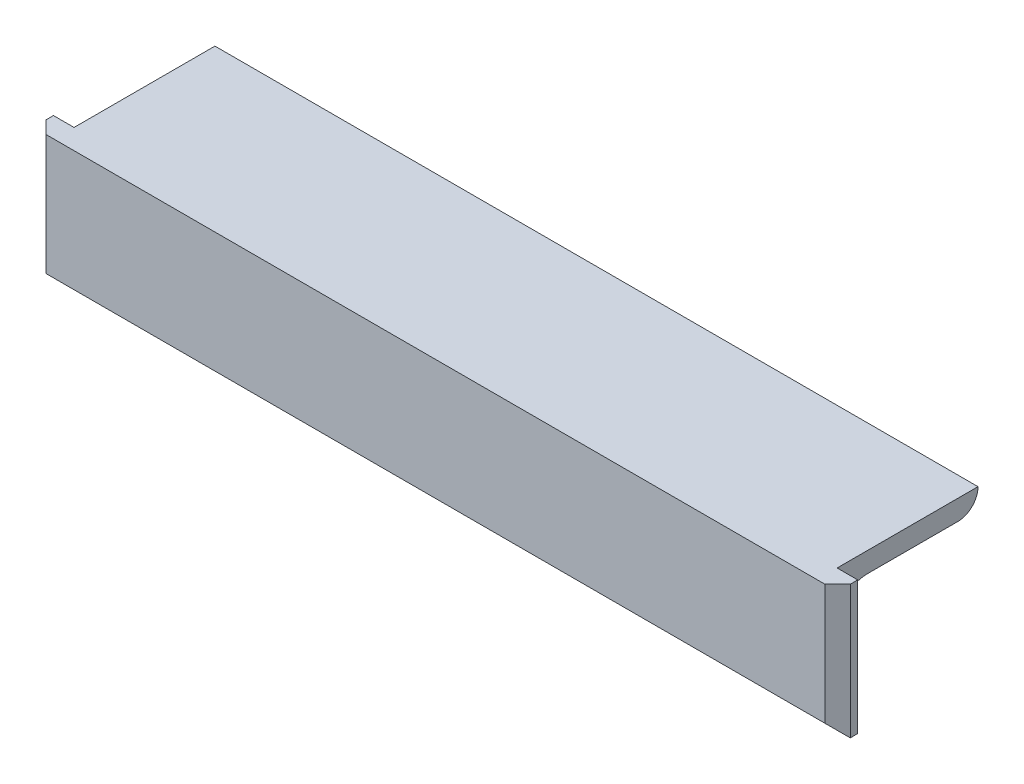
ISO-10303-21;
HEADER;
FILE_DESCRIPTION(('STEP AP214'),'2;1');
FILE_NAME('part.step','',(''),(''),'','','');
FILE_SCHEMA(('AUTOMOTIVE_DESIGN { 1 0 10303 214 1 1 1 1 }'));
ENDSEC;
DATA;
#1=APPLICATION_CONTEXT('core data for automotive mechanical design processes');
#2=APPLICATION_PROTOCOL_DEFINITION('international standard','automotive_design',2000,#1);
#3=PRODUCT_CONTEXT('',#1,'mechanical');
#4=PRODUCT('Part','Part','',(#3));
#5=PRODUCT_RELATED_PRODUCT_CATEGORY('part','',(#4));
#6=PRODUCT_DEFINITION_FORMATION('','',#4);
#7=PRODUCT_DEFINITION_CONTEXT('part definition',#1,'design');
#8=PRODUCT_DEFINITION('design','',#6,#7);
#9=PRODUCT_DEFINITION_SHAPE('','',#8);
#10=(LENGTH_UNIT() NAMED_UNIT(*) SI_UNIT(.MILLI.,.METRE.));
#11=(NAMED_UNIT(*) PLANE_ANGLE_UNIT() SI_UNIT($,.RADIAN.));
#12=(NAMED_UNIT(*) SI_UNIT($,.STERADIAN.) SOLID_ANGLE_UNIT());
#13=UNCERTAINTY_MEASURE_WITH_UNIT(LENGTH_MEASURE(1.E-05),#10,'distance_accuracy_value','');
#14=(GEOMETRIC_REPRESENTATION_CONTEXT(3) GLOBAL_UNCERTAINTY_ASSIGNED_CONTEXT((#13)) GLOBAL_UNIT_ASSIGNED_CONTEXT((#10,
#11,#12)) REPRESENTATION_CONTEXT('',''));
#15=CARTESIAN_POINT('',(0.,0.,0.));
#16=DIRECTION('',(0.,0.,1.));
#17=DIRECTION('',(1.,0.,0.));
#18=AXIS2_PLACEMENT_3D('',#15,#16,#17);
#19=CARTESIAN_POINT('',(63.435,-7.93749999999994,-7.93750000000005));
#20=DIRECTION('',(-1.,0.,0.));
#21=DIRECTION('',(0.,-1.,0.));
#22=AXIS2_PLACEMENT_3D('',#19,#20,#21);
#23=CYLINDRICAL_SURFACE('',#22,4.7625);
#24=CARTESIAN_POINT('',(-60.185,-7.93749999999996,-7.93750000000005));
#25=DIRECTION('',(-1.,0.,0.));
#26=DIRECTION('',(0.,0.,1.));
#27=AXIS2_PLACEMENT_3D('',#24,#25,#26);
#28=CIRCLE('',#27,4.7625);
#29=CARTESIAN_POINT('',(-60.185,-3.17499999999996,-7.93750000000002));
#30=VERTEX_POINT('',#29);
#31=CARTESIAN_POINT('',(-60.185,-7.93749999999999,-3.17500000000005));
#32=VERTEX_POINT('',#31);
#33=EDGE_CURVE('E190',#30,#32,#28,.F.);
#34=ORIENTED_EDGE('',*,*,#33,.F.);
#35=DIRECTION('',(-1.,0.,0.));
#36=VECTOR('',#35,1.);
#37=CARTESIAN_POINT('',(63.435,-3.17499999999994,-7.93750000000002));
#38=LINE('',#37,#36);
#39=CARTESIAN_POINT('',(60.185,-3.17499999999994,-7.93750000000002));
#40=VERTEX_POINT('',#39);
#41=EDGE_CURVE('E204',#40,#30,#38,.T.);
#42=ORIENTED_EDGE('',*,*,#41,.F.);
#43=CARTESIAN_POINT('',(60.185,-7.93749999999994,-7.93750000000005));
#44=DIRECTION('',(-1.,0.,0.));
#45=DIRECTION('',(0.,0.,1.));
#46=AXIS2_PLACEMENT_3D('',#43,#44,#45);
#47=CIRCLE('',#46,4.7625);
#48=CARTESIAN_POINT('',(60.185,-7.93749999999997,-3.17500000000005));
#49=VERTEX_POINT('',#48);
#50=EDGE_CURVE('E263',#40,#49,#47,.F.);
#51=ORIENTED_EDGE('',*,*,#50,.T.);
#52=DIRECTION('',(-1.,0.,0.));
#53=VECTOR('',#52,1.);
#54=CARTESIAN_POINT('',(63.435,-7.93749999999997,-3.17500000000005));
#55=LINE('',#54,#53);
#56=EDGE_CURVE('E167',#49,#32,#55,.T.);
#57=ORIENTED_EDGE('',*,*,#56,.T.);
#58=EDGE_LOOP('',(#34,#42,#51,#57));
#59=FACE_BOUND('',#58,.T.);
#60=ADVANCED_FACE('F66',(#59),#23,.F.);
#61=CARTESIAN_POINT('',(63.435,-3.17499999999982,-22.23008));
#62=DIRECTION('',(0.,1.,0.));
#63=DIRECTION('',(0.,0.,1.));
#64=AXIS2_PLACEMENT_3D('',#61,#62,#63);
#65=PLANE('',#64);
#66=DIRECTION('',(0.,0.,1.));
#67=VECTOR('',#66,1.);
#68=CARTESIAN_POINT('',(-60.185,-3.17499999999984,-22.23008));
#69=LINE('',#68,#67);
#70=CARTESIAN_POINT('',(-60.185,-3.17499999999984,-22.23008));
#71=VERTEX_POINT('',#70);
#72=EDGE_CURVE('E267',#71,#30,#69,.T.);
#73=ORIENTED_EDGE('',*,*,#72,.F.);
#74=DIRECTION('',(-1.,0.,0.));
#75=VECTOR('',#74,1.);
#76=CARTESIAN_POINT('',(63.435,-3.17499999999981,-22.23008));
#77=LINE('',#76,#75);
#78=CARTESIAN_POINT('',(60.185,-3.17499999999981,-22.23008));
#79=VERTEX_POINT('',#78);
#80=EDGE_CURVE('E201',#79,#71,#77,.T.);
#81=ORIENTED_EDGE('',*,*,#80,.F.);
#82=DIRECTION('',(0.,0.,1.));
#83=VECTOR('',#82,1.);
#84=CARTESIAN_POINT('',(60.185,-3.17499999999982,-22.23008));
#85=LINE('',#84,#83);
#86=EDGE_CURVE('E260',#79,#40,#85,.T.);
#87=ORIENTED_EDGE('',*,*,#86,.T.);
#88=ORIENTED_EDGE('',*,*,#41,.T.);
#89=EDGE_LOOP('',(#73,#81,#87,#88));
#90=FACE_BOUND('',#89,.T.);
#91=ADVANCED_FACE('F281',(#90),#65,.F.);
#92=CARTESIAN_POINT('',(63.435,-0.00507999999982166,-22.23008));
#93=DIRECTION('',(-1.,0.,0.));
#94=DIRECTION('',(0.,-1.,0.));
#95=AXIS2_PLACEMENT_3D('',#92,#93,#94);
#96=CYLINDRICAL_SURFACE('',#95,3.16991999999999);
#97=CARTESIAN_POINT('',(-60.185,-0.00507999999984437,-22.23008));
#98=DIRECTION('',(-1.,0.,0.));
#99=DIRECTION('',(0.,0.,1.));
#100=AXIS2_PLACEMENT_3D('',#97,#98,#99);
#101=CIRCLE('',#100,3.16991999999999);
#102=CARTESIAN_POINT('',(-60.185,-0.00507999999982238,-25.4));
#103=VERTEX_POINT('',#102);
#104=EDGE_CURVE('E266',#103,#71,#101,.T.);
#105=ORIENTED_EDGE('',*,*,#104,.F.);
#106=DIRECTION('',(-1.,0.,0.));
#107=VECTOR('',#106,1.);
#108=CARTESIAN_POINT('',(63.435,-0.00507999999979933,-25.4));
#109=LINE('',#108,#107);
#110=CARTESIAN_POINT('',(60.185,-0.00507999999982238,-25.4));
#111=VERTEX_POINT('',#110);
#112=EDGE_CURVE('E198',#111,#103,#109,.T.);
#113=ORIENTED_EDGE('',*,*,#112,.F.);
#114=CARTESIAN_POINT('',(60.185,-0.00507999999982225,-22.23008));
#115=DIRECTION('',(-1.,0.,0.));
#116=DIRECTION('',(0.,0.,1.));
#117=AXIS2_PLACEMENT_3D('',#114,#115,#116);
#118=CIRCLE('',#117,3.16991999999999);
#119=EDGE_CURVE('E251',#111,#79,#118,.T.);
#120=ORIENTED_EDGE('',*,*,#119,.T.);
#121=ORIENTED_EDGE('',*,*,#80,.T.);
#122=EDGE_LOOP('',(#105,#113,#120,#121));
#123=FACE_BOUND('',#122,.T.);
#124=ADVANCED_FACE('F284',(#123),#96,.T.);
#125=CARTESIAN_POINT('',(63.435,2.00672892924405E-13,-25.4));
#126=DIRECTION('',(0.,0.,1.));
#127=DIRECTION('',(1.,0.,0.));
#128=AXIS2_PLACEMENT_3D('',#125,#126,#127);
#129=PLANE('',#128);
#130=DIRECTION('',(0.,1.,0.));
#131=VECTOR('',#130,1.);
#132=CARTESIAN_POINT('',(-60.185,-9.99999999999982,-25.4000000000001));
#133=LINE('',#132,#131);
#134=CARTESIAN_POINT('',(-60.185,1.77367252013231E-13,-25.4));
#135=VERTEX_POINT('',#134);
#136=EDGE_CURVE('E248',#103,#135,#133,.T.);
#137=ORIENTED_EDGE('',*,*,#136,.T.);
#138=DIRECTION('',(-1.,0.,0.));
#139=VECTOR('',#138,1.);
#140=CARTESIAN_POINT('',(63.435,2.00672892924405E-13,-25.4));
#141=LINE('',#140,#139);
#142=CARTESIAN_POINT('',(60.185,1.77367252013231E-13,-25.4));
#143=VERTEX_POINT('',#142);
#144=EDGE_CURVE('E195',#143,#135,#141,.T.);
#145=ORIENTED_EDGE('',*,*,#144,.F.);
#146=DIRECTION('',(0.,1.,0.));
#147=VECTOR('',#146,1.);
#148=CARTESIAN_POINT('',(60.185,-9.99999999999982,-25.4000000000001));
#149=LINE('',#148,#147);
#150=EDGE_CURVE('E255',#111,#143,#149,.T.);
#151=ORIENTED_EDGE('',*,*,#150,.F.);
#152=ORIENTED_EDGE('',*,*,#112,.T.);
#153=EDGE_LOOP('',(#137,#145,#151,#152));
#154=FACE_BOUND('',#153,.T.);
#155=ADVANCED_FACE('F290',(#154),#129,.F.);
#156=CARTESIAN_POINT('',(63.435,0.,0.));
#157=DIRECTION('',(0.,-1.,0.));
#158=DIRECTION('',(0.,0.,-1.));
#159=AXIS2_PLACEMENT_3D('',#156,#157,#158);
#160=PLANE('',#159);
#161=DIRECTION('',(-1.,0.,0.));
#162=VECTOR('',#161,1.);
#163=CARTESIAN_POINT('',(63.435,0.,0.));
#164=LINE('',#163,#162);
#165=CARTESIAN_POINT('',(61.435,0.,0.));
#166=VERTEX_POINT('',#165);
#167=CARTESIAN_POINT('',(-61.435,0.,0.));
#168=VERTEX_POINT('',#167);
#169=EDGE_CURVE('E185',#166,#168,#164,.T.);
#170=ORIENTED_EDGE('',*,*,#169,.F.);
#171=DIRECTION('',(-0.70710678118655,0.,0.707106781186545));
#172=VECTOR('',#171,1.);
#173=CARTESIAN_POINT('',(63.435,0.,-1.99999999999999));
#174=LINE('',#173,#172);
#175=CARTESIAN_POINT('',(63.435,0.,-1.99999999999999));
#176=VERTEX_POINT('',#175);
#177=EDGE_CURVE('E74',#166,#176,#174,.F.);
#178=ORIENTED_EDGE('',*,*,#177,.T.);
#179=DIRECTION('',(0.,0.,1.));
#180=VECTOR('',#179,1.);
#181=CARTESIAN_POINT('',(63.435,0.,0.));
#182=LINE('',#181,#180);
#183=CARTESIAN_POINT('',(63.435,0.,-3.175));
#184=VERTEX_POINT('',#183);
#185=EDGE_CURVE('E182',#184,#176,#182,.T.);
#186=ORIENTED_EDGE('',*,*,#185,.F.);
#187=DIRECTION('',(-1.,0.,0.));
#188=VECTOR('',#187,1.);
#189=CARTESIAN_POINT('',(0.,0.,-3.17499999999999));
#190=LINE('',#189,#188);
#191=CARTESIAN_POINT('',(60.185,0.,-3.17499999999999));
#192=VERTEX_POINT('',#191);
#193=EDGE_CURVE('E180',#184,#192,#190,.T.);
#194=ORIENTED_EDGE('',*,*,#193,.T.);
#195=DIRECTION('',(0.,0.,1.));
#196=VECTOR('',#195,1.);
#197=CARTESIAN_POINT('',(60.185,0.,0.));
#198=LINE('',#197,#196);
#199=EDGE_CURVE('E236',#143,#192,#198,.T.);
#200=ORIENTED_EDGE('',*,*,#199,.F.);
#201=ORIENTED_EDGE('',*,*,#144,.T.);
#202=DIRECTION('',(0.,0.,1.));
#203=VECTOR('',#202,1.);
#204=CARTESIAN_POINT('',(-60.185,0.,0.));
#205=LINE('',#204,#203);
#206=CARTESIAN_POINT('',(-60.185,0.,-3.17499999999999));
#207=VERTEX_POINT('',#206);
#208=EDGE_CURVE('E241',#135,#207,#205,.T.);
#209=ORIENTED_EDGE('',*,*,#208,.T.);
#210=DIRECTION('',(-1.,0.,0.));
#211=VECTOR('',#210,1.);
#212=CARTESIAN_POINT('',(0.,0.,-3.17499999999999));
#213=LINE('',#212,#211);
#214=CARTESIAN_POINT('',(-63.435,0.,-3.17499999999999));
#215=VERTEX_POINT('',#214);
#216=EDGE_CURVE('E244',#207,#215,#213,.T.);
#217=ORIENTED_EDGE('',*,*,#216,.T.);
#218=DIRECTION('',(0.,0.,1.));
#219=VECTOR('',#218,1.);
#220=CARTESIAN_POINT('',(-63.435,0.,0.));
#221=LINE('',#220,#219);
#222=CARTESIAN_POINT('',(-63.435,0.,-2.00000000000003));
#223=VERTEX_POINT('',#222);
#224=EDGE_CURVE('E183',#215,#223,#221,.T.);
#225=ORIENTED_EDGE('',*,*,#224,.T.);
#226=DIRECTION('',(0.707106781186542,0.,0.707106781186553));
#227=VECTOR('',#226,1.);
#228=CARTESIAN_POINT('',(-61.435,0.,0.));
#229=LINE('',#228,#227);
#230=EDGE_CURVE('E86',#223,#168,#229,.T.);
#231=ORIENTED_EDGE('',*,*,#230,.T.);
#232=EDGE_LOOP('',(#170,#178,#186,#194,#200,#201,#209,#217,#225,#231));
#233=FACE_BOUND('',#232,.T.);
#234=ADVANCED_FACE('F224',(#233),#160,.F.);
#235=CARTESIAN_POINT('',(63.435,-0.00507999999982166,-22.23008));
#236=DIRECTION('',(-1.,0.,0.));
#237=DIRECTION('',(0.,-1.,0.));
#238=AXIS2_PLACEMENT_3D('',#235,#236,#237);
#239=PLANE('',#238);
#240=ORIENTED_EDGE('',*,*,#185,.T.);
#241=DIRECTION('',(0.,-1.,0.));
#242=VECTOR('',#241,1.);
#243=CARTESIAN_POINT('',(63.435,-0.00507999999996292,-1.99999999999999));
#244=LINE('',#243,#242);
#245=CARTESIAN_POINT('',(63.435,-21.,-1.99999999999999));
#246=VERTEX_POINT('',#245);
#247=EDGE_CURVE('E176',#176,#246,#244,.T.);
#248=ORIENTED_EDGE('',*,*,#247,.T.);
#249=DIRECTION('',(0.,0.,1.));
#250=VECTOR('',#249,1.);
#251=CARTESIAN_POINT('',(63.435,-21.,-10.));
#252=LINE('',#251,#250);
#253=CARTESIAN_POINT('',(63.435,-21.,-3.17500000000015));
#254=VERTEX_POINT('',#253);
#255=EDGE_CURVE('E160',#254,#246,#252,.T.);
#256=ORIENTED_EDGE('',*,*,#255,.F.);
#257=DIRECTION('',(0.,1.,0.));
#258=VECTOR('',#257,1.);
#259=CARTESIAN_POINT('',(63.435,-7.93749999999997,-3.17500000000005));
#260=LINE('',#259,#258);
#261=EDGE_CURVE('E173',#254,#184,#260,.T.);
#262=ORIENTED_EDGE('',*,*,#261,.T.);
#263=EDGE_LOOP('',(#240,#248,#256,#262));
#264=FACE_BOUND('',#263,.T.);
#265=ADVANCED_FACE('F172',(#264),#239,.F.);
#266=CARTESIAN_POINT('',(-63.435,-0.00507999999984496,-22.23008));
#267=DIRECTION('',(-1.,0.,0.));
#268=DIRECTION('',(0.,-1.,0.));
#269=AXIS2_PLACEMENT_3D('',#266,#267,#268);
#270=PLANE('',#269);
#271=DIRECTION('',(0.,0.,1.));
#272=VECTOR('',#271,1.);
#273=CARTESIAN_POINT('',(-63.435,-21.,-10.));
#274=LINE('',#273,#272);
#275=CARTESIAN_POINT('',(-63.435,-21.,-3.17500000000014));
#276=VERTEX_POINT('',#275);
#277=CARTESIAN_POINT('',(-63.435,-21.,-1.99999999999999));
#278=VERTEX_POINT('',#277);
#279=EDGE_CURVE('E162',#276,#278,#274,.T.);
#280=ORIENTED_EDGE('',*,*,#279,.T.);
#281=DIRECTION('',(0.,1.,0.));
#282=VECTOR('',#281,1.);
#283=CARTESIAN_POINT('',(-63.435,0.,-2.00000000000003));
#284=LINE('',#283,#282);
#285=EDGE_CURVE('E13',#278,#223,#284,.T.);
#286=ORIENTED_EDGE('',*,*,#285,.T.);
#287=ORIENTED_EDGE('',*,*,#224,.F.);
#288=DIRECTION('',(0.,1.,0.));
#289=VECTOR('',#288,1.);
#290=CARTESIAN_POINT('',(-63.435,-7.93749999999999,-3.17500000000005));
#291=LINE('',#290,#289);
#292=EDGE_CURVE('E187',#276,#215,#291,.T.);
#293=ORIENTED_EDGE('',*,*,#292,.F.);
#294=EDGE_LOOP('',(#280,#286,#287,#293));
#295=FACE_BOUND('',#294,.T.);
#296=ADVANCED_FACE('F235',(#295),#270,.T.);
#297=CARTESIAN_POINT('',(63.435,-25.4,-1.77367252013231E-13));
#298=DIRECTION('',(0.,0.,-1.));
#299=DIRECTION('',(0.,1.,0.));
#300=AXIS2_PLACEMENT_3D('',#297,#298,#299);
#301=PLANE('',#300);
#302=DIRECTION('',(1.,0.,0.));
#303=VECTOR('',#302,1.);
#304=CARTESIAN_POINT('',(63.435,-19.0000000000002,-1.3267629087604E-13));
#305=LINE('',#304,#303);
#306=CARTESIAN_POINT('',(-61.435,-19.0000000000002,-1.3267629087604E-13));
#307=VERTEX_POINT('',#306);
#308=CARTESIAN_POINT('',(61.435,-19.0000000000002,-1.3267629087604E-13));
#309=VERTEX_POINT('',#308);
#310=EDGE_CURVE('E210',#307,#309,#305,.T.);
#311=ORIENTED_EDGE('',*,*,#310,.T.);
#312=DIRECTION('',(0.,1.,0.));
#313=VECTOR('',#312,1.);
#314=CARTESIAN_POINT('',(61.435,-25.4,-1.77367252013231E-13));
#315=LINE('',#314,#313);
#316=EDGE_CURVE('E221',#309,#166,#315,.T.);
#317=ORIENTED_EDGE('',*,*,#316,.T.);
#318=ORIENTED_EDGE('',*,*,#169,.T.);
#319=DIRECTION('',(0.,-1.,0.));
#320=VECTOR('',#319,1.);
#321=CARTESIAN_POINT('',(-61.435,-19.0000000000002,-1.3267629087604E-13));
#322=LINE('',#321,#320);
#323=EDGE_CURVE('E218',#168,#307,#322,.T.);
#324=ORIENTED_EDGE('',*,*,#323,.T.);
#325=EDGE_LOOP('',(#311,#317,#318,#324));
#326=FACE_BOUND('',#325,.T.);
#327=ADVANCED_FACE('F232',(#326),#301,.F.);
#328=CARTESIAN_POINT('',(63.435,-7.93749999999997,-3.17500000000005));
#329=DIRECTION('',(0.,0.,1.));
#330=DIRECTION('',(0.,-1.,0.));
#331=AXIS2_PLACEMENT_3D('',#328,#329,#330);
#332=PLANE('',#331);
#333=ORIENTED_EDGE('',*,*,#261,.F.);
#334=DIRECTION('',(-1.,0.,0.));
#335=VECTOR('',#334,1.);
#336=CARTESIAN_POINT('',(63.435,-21.,-3.17500000000014));
#337=LINE('',#336,#335);
#338=EDGE_CURVE('E156',#254,#276,#337,.T.);
#339=ORIENTED_EDGE('',*,*,#338,.T.);
#340=ORIENTED_EDGE('',*,*,#292,.T.);
#341=ORIENTED_EDGE('',*,*,#216,.F.);
#342=DIRECTION('',(0.,1.,0.));
#343=VECTOR('',#342,1.);
#344=CARTESIAN_POINT('',(-60.185,-9.99999999999998,-3.17500000000007));
#345=LINE('',#344,#343);
#346=EDGE_CURVE('E249',#32,#207,#345,.T.);
#347=ORIENTED_EDGE('',*,*,#346,.F.);
#348=ORIENTED_EDGE('',*,*,#56,.F.);
#349=DIRECTION('',(0.,1.,0.));
#350=VECTOR('',#349,1.);
#351=CARTESIAN_POINT('',(60.185,-9.99999999999998,-3.17500000000007));
#352=LINE('',#351,#350);
#353=EDGE_CURVE('E245',#49,#192,#352,.T.);
#354=ORIENTED_EDGE('',*,*,#353,.T.);
#355=ORIENTED_EDGE('',*,*,#193,.F.);
#356=EDGE_LOOP('',(#333,#339,#340,#341,#347,#348,#354,#355));
#357=FACE_BOUND('',#356,.T.);
#358=ADVANCED_FACE('F178',(#357),#332,.F.);
#359=CARTESIAN_POINT('',(-60.185,-10.,0.));
#360=DIRECTION('',(-1.,0.,0.));
#361=DIRECTION('',(0.,0.,1.));
#362=AXIS2_PLACEMENT_3D('',#359,#360,#361);
#363=PLANE('',#362);
#364=ORIENTED_EDGE('',*,*,#33,.T.);
#365=ORIENTED_EDGE('',*,*,#346,.T.);
#366=ORIENTED_EDGE('',*,*,#208,.F.);
#367=ORIENTED_EDGE('',*,*,#136,.F.);
#368=ORIENTED_EDGE('',*,*,#104,.T.);
#369=ORIENTED_EDGE('',*,*,#72,.T.);
#370=EDGE_LOOP('',(#364,#365,#366,#367,#368,#369));
#371=FACE_BOUND('',#370,.T.);
#372=ADVANCED_FACE('F272',(#371),#363,.T.);
#373=CARTESIAN_POINT('',(60.185,-10.,0.));
#374=DIRECTION('',(-1.,0.,0.));
#375=DIRECTION('',(0.,0.,1.));
#376=AXIS2_PLACEMENT_3D('',#373,#374,#375);
#377=PLANE('',#376);
#378=ORIENTED_EDGE('',*,*,#86,.F.);
#379=ORIENTED_EDGE('',*,*,#119,.F.);
#380=ORIENTED_EDGE('',*,*,#150,.T.);
#381=ORIENTED_EDGE('',*,*,#199,.T.);
#382=ORIENTED_EDGE('',*,*,#353,.F.);
#383=ORIENTED_EDGE('',*,*,#50,.F.);
#384=EDGE_LOOP('',(#378,#379,#380,#381,#382,#383));
#385=FACE_BOUND('',#384,.T.);
#386=ADVANCED_FACE('F278',(#385),#377,.F.);
#387=CARTESIAN_POINT('',(-63.435,-21.,-10.));
#388=DIRECTION('',(0.,1.,0.));
#389=DIRECTION('',(0.,0.,1.));
#390=AXIS2_PLACEMENT_3D('',#387,#388,#389);
#391=PLANE('',#390);
#392=ORIENTED_EDGE('',*,*,#255,.T.);
#393=DIRECTION('',(-1.,0.,0.));
#394=VECTOR('',#393,1.);
#395=CARTESIAN_POINT('',(-63.435,-21.,-1.99999999999999));
#396=LINE('',#395,#394);
#397=EDGE_CURVE('E166',#246,#278,#396,.T.);
#398=ORIENTED_EDGE('',*,*,#397,.T.);
#399=ORIENTED_EDGE('',*,*,#279,.F.);
#400=ORIENTED_EDGE('',*,*,#338,.F.);
#401=EDGE_LOOP('',(#392,#398,#399,#400));
#402=FACE_BOUND('',#401,.T.);
#403=ADVANCED_FACE('F158',(#402),#391,.F.);
#404=CARTESIAN_POINT('',(-63.435,-21.,-1.99999999999999));
#405=DIRECTION('',(0.,0.707106781186552,-0.707106781186543));
#406=DIRECTION('',(-1.,0.,0.));
#407=AXIS2_PLACEMENT_3D('',#404,#405,#406);
#408=PLANE('',#407);
#409=ORIENTED_EDGE('',*,*,#397,.F.);
#410=DIRECTION('',(-0.577350269189628,0.577350269189621,0.577350269189629));
#411=VECTOR('',#410,1.);
#412=CARTESIAN_POINT('',(21.1449999999996,21.2899999999998,40.2900000000003));
#413=LINE('',#412,#411);
#414=EDGE_CURVE('E216',#246,#309,#413,.T.);
#415=ORIENTED_EDGE('',*,*,#414,.T.);
#416=ORIENTED_EDGE('',*,*,#310,.F.);
#417=DIRECTION('',(0.577350269189619,0.577350269189625,0.577350269189633));
#418=VECTOR('',#417,1.);
#419=CARTESIAN_POINT('',(-63.4349999999999,-21.0000000000001,-2.00000000000006));
#420=LINE('',#419,#418);
#421=EDGE_CURVE('E214',#307,#278,#420,.F.);
#422=ORIENTED_EDGE('',*,*,#421,.T.);
#423=EDGE_LOOP('',(#409,#415,#416,#422));
#424=FACE_BOUND('',#423,.T.);
#425=ADVANCED_FACE('F230',(#424),#408,.F.);
#426=CARTESIAN_POINT('',(63.435,-0.00507999999996292,-1.99999999999999));
#427=DIRECTION('',(-0.707106781186545,0.,-0.70710678118655));
#428=DIRECTION('',(0.,-1.,0.));
#429=AXIS2_PLACEMENT_3D('',#426,#427,#428);
#430=PLANE('',#429);
#431=ORIENTED_EDGE('',*,*,#177,.F.);
#432=ORIENTED_EDGE('',*,*,#316,.F.);
#433=ORIENTED_EDGE('',*,*,#414,.F.);
#434=ORIENTED_EDGE('',*,*,#247,.F.);
#435=EDGE_LOOP('',(#431,#432,#433,#434));
#436=FACE_BOUND('',#435,.T.);
#437=ADVANCED_FACE('F227',(#436),#430,.F.);
#438=CARTESIAN_POINT('',(-61.435,-25.4,-1.77367252013231E-13));
#439=DIRECTION('',(-0.707106781186553,0.,0.707106781186542));
#440=DIRECTION('',(0.,1.,0.));
#441=AXIS2_PLACEMENT_3D('',#438,#439,#440);
#442=PLANE('',#441);
#443=ORIENTED_EDGE('',*,*,#230,.F.);
#444=ORIENTED_EDGE('',*,*,#285,.F.);
#445=ORIENTED_EDGE('',*,*,#421,.F.);
#446=ORIENTED_EDGE('',*,*,#323,.F.);
#447=EDGE_LOOP('',(#443,#444,#445,#446));
#448=FACE_BOUND('',#447,.T.);
#449=ADVANCED_FACE('F68',(#448),#442,.T.);
#450=CLOSED_SHELL('',(#60,#91,#124,#155,#234,#265,#296,#327,#358,#372,#386,#403,#425,#437,#449));
#451=MANIFOLD_SOLID_BREP('B2',#450);
#452=ADVANCED_BREP_SHAPE_REPRESENTATION('',(#18,#451),#14);
#453=SHAPE_DEFINITION_REPRESENTATION(#9,#452);
ENDSEC;
END-ISO-10303-21;
